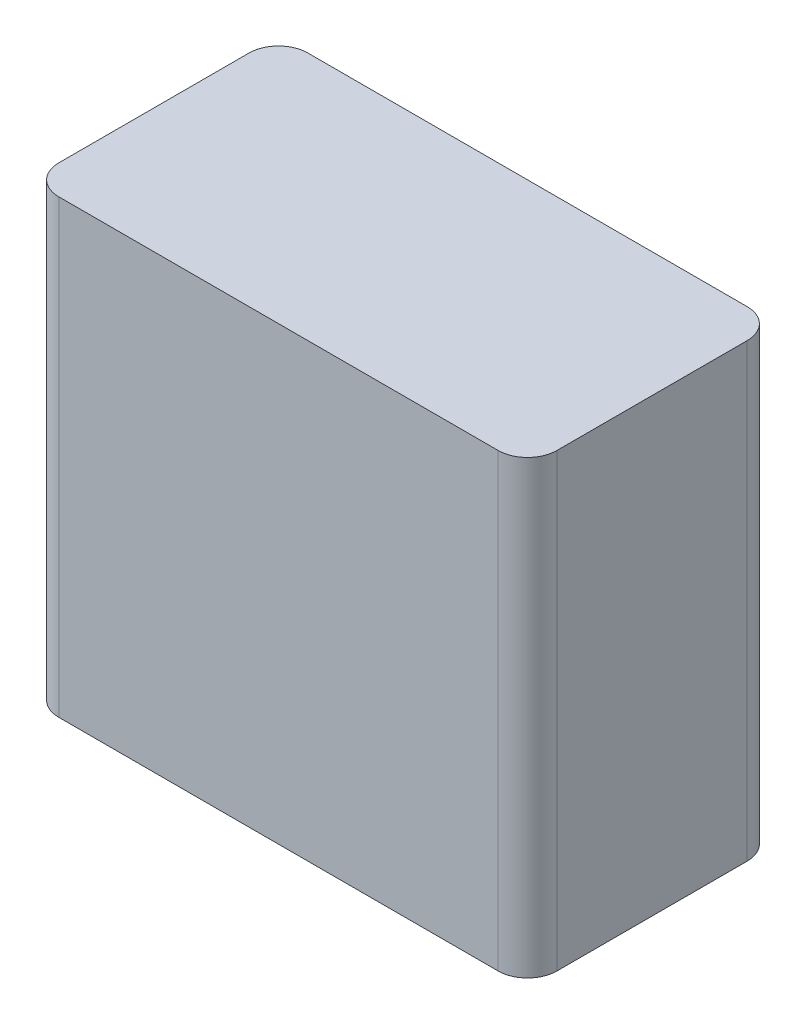
ISO-10303-21;
HEADER;
FILE_DESCRIPTION(('STEP AP214'),'2;1');
FILE_NAME('part.step','',(''),(''),'','','');
FILE_SCHEMA(('AUTOMOTIVE_DESIGN { 1 0 10303 214 1 1 1 1 }'));
ENDSEC;
DATA;
#1=APPLICATION_CONTEXT('core data for automotive mechanical design processes');
#2=APPLICATION_PROTOCOL_DEFINITION('international standard','automotive_design',2000,#1);
#3=PRODUCT_CONTEXT('',#1,'mechanical');
#4=PRODUCT('Part','Part','',(#3));
#5=PRODUCT_RELATED_PRODUCT_CATEGORY('part','',(#4));
#6=PRODUCT_DEFINITION_FORMATION('','',#4);
#7=PRODUCT_DEFINITION_CONTEXT('part definition',#1,'design');
#8=PRODUCT_DEFINITION('design','',#6,#7);
#9=PRODUCT_DEFINITION_SHAPE('','',#8);
#10=(LENGTH_UNIT() NAMED_UNIT(*) SI_UNIT(.MILLI.,.METRE.));
#11=(NAMED_UNIT(*) PLANE_ANGLE_UNIT() SI_UNIT($,.RADIAN.));
#12=(NAMED_UNIT(*) SI_UNIT($,.STERADIAN.) SOLID_ANGLE_UNIT());
#13=UNCERTAINTY_MEASURE_WITH_UNIT(LENGTH_MEASURE(1.E-05),#10,'distance_accuracy_value','');
#14=(GEOMETRIC_REPRESENTATION_CONTEXT(3) GLOBAL_UNCERTAINTY_ASSIGNED_CONTEXT((#13)) GLOBAL_UNIT_ASSIGNED_CONTEXT((#10,
#11,#12)) REPRESENTATION_CONTEXT('',''));
#15=CARTESIAN_POINT('',(0.,0.,0.));
#16=DIRECTION('',(0.,0.,1.));
#17=DIRECTION('',(1.,0.,0.));
#18=AXIS2_PLACEMENT_3D('',#15,#16,#17);
#19=CARTESIAN_POINT('',(-20.,36.2,10.));
#20=DIRECTION('',(1.,0.,0.));
#21=DIRECTION('',(0.,0.,-1.));
#22=AXIS2_PLACEMENT_3D('',#19,#20,#21);
#23=PLANE('',#22);
#24=DIRECTION('',(0.,0.,1.));
#25=VECTOR('',#24,1.);
#26=CARTESIAN_POINT('',(-20.,36.2,10.));
#27=LINE('',#26,#25);
#28=CARTESIAN_POINT('',(-20.,36.2,-7.63999999999999));
#29=VERTEX_POINT('',#28);
#30=CARTESIAN_POINT('',(-20.,36.2,7.64));
#31=VERTEX_POINT('',#30);
#32=EDGE_CURVE('E126',#29,#31,#27,.T.);
#33=ORIENTED_EDGE('',*,*,#32,.F.);
#34=DIRECTION('',(0.,-1.,0.));
#35=VECTOR('',#34,1.);
#36=CARTESIAN_POINT('',(-20.,36.2,-7.63999999999999));
#37=LINE('',#36,#35);
#38=CARTESIAN_POINT('',(-20.,0.,-7.63999999999999));
#39=VERTEX_POINT('',#38);
#40=EDGE_CURVE('E110',#29,#39,#37,.T.);
#41=ORIENTED_EDGE('',*,*,#40,.T.);
#42=DIRECTION('',(0.,0.,1.));
#43=VECTOR('',#42,1.);
#44=CARTESIAN_POINT('',(-20.,0.,10.));
#45=LINE('',#44,#43);
#46=CARTESIAN_POINT('',(-20.,0.,7.64));
#47=VERTEX_POINT('',#46);
#48=EDGE_CURVE('E123',#39,#47,#45,.T.);
#49=ORIENTED_EDGE('',*,*,#48,.T.);
#50=DIRECTION('',(0.,-1.,0.));
#51=VECTOR('',#50,1.);
#52=CARTESIAN_POINT('',(-20.,36.2,7.64));
#53=LINE('',#52,#51);
#54=EDGE_CURVE('E129',#47,#31,#53,.F.);
#55=ORIENTED_EDGE('',*,*,#54,.T.);
#56=EDGE_LOOP('',(#33,#41,#49,#55));
#57=FACE_BOUND('',#56,.T.);
#58=ADVANCED_FACE('F38',(#57),#23,.F.);
#59=CARTESIAN_POINT('',(20.,36.2,10.));
#60=DIRECTION('',(0.,0.,-1.));
#61=DIRECTION('',(-1.,0.,0.));
#62=AXIS2_PLACEMENT_3D('',#59,#60,#61);
#63=PLANE('',#62);
#64=DIRECTION('',(1.,0.,0.));
#65=VECTOR('',#64,1.);
#66=CARTESIAN_POINT('',(20.,36.2,10.));
#67=LINE('',#66,#65);
#68=CARTESIAN_POINT('',(-17.64,36.2,10.));
#69=VERTEX_POINT('',#68);
#70=CARTESIAN_POINT('',(17.64,36.2,10.));
#71=VERTEX_POINT('',#70);
#72=EDGE_CURVE('E184',#69,#71,#67,.T.);
#73=ORIENTED_EDGE('',*,*,#72,.F.);
#74=DIRECTION('',(0.,-1.,0.));
#75=VECTOR('',#74,1.);
#76=CARTESIAN_POINT('',(-17.64,36.2,10.));
#77=LINE('',#76,#75);
#78=CARTESIAN_POINT('',(-17.64,0.,10.));
#79=VERTEX_POINT('',#78);
#80=EDGE_CURVE('E11',#69,#79,#77,.T.);
#81=ORIENTED_EDGE('',*,*,#80,.T.);
#82=DIRECTION('',(1.,0.,0.));
#83=VECTOR('',#82,1.);
#84=CARTESIAN_POINT('',(20.,0.,10.));
#85=LINE('',#84,#83);
#86=CARTESIAN_POINT('',(17.64,0.,10.));
#87=VERTEX_POINT('',#86);
#88=EDGE_CURVE('E135',#79,#87,#85,.T.);
#89=ORIENTED_EDGE('',*,*,#88,.T.);
#90=DIRECTION('',(0.,-1.,0.));
#91=VECTOR('',#90,1.);
#92=CARTESIAN_POINT('',(17.64,36.2,10.));
#93=LINE('',#92,#91);
#94=EDGE_CURVE('E47',#87,#71,#93,.F.);
#95=ORIENTED_EDGE('',*,*,#94,.T.);
#96=EDGE_LOOP('',(#73,#81,#89,#95));
#97=FACE_BOUND('',#96,.T.);
#98=ADVANCED_FACE('F183',(#97),#63,.F.);
#99=CARTESIAN_POINT('',(20.,36.2,10.));
#100=DIRECTION('',(-1.,0.,0.));
#101=DIRECTION('',(0.,0.,1.));
#102=AXIS2_PLACEMENT_3D('',#99,#100,#101);
#103=PLANE('',#102);
#104=DIRECTION('',(0.,0.,-1.));
#105=VECTOR('',#104,1.);
#106=CARTESIAN_POINT('',(20.,0.,10.));
#107=LINE('',#106,#105);
#108=CARTESIAN_POINT('',(20.,0.,7.64));
#109=VERTEX_POINT('',#108);
#110=CARTESIAN_POINT('',(20.,0.,-7.64));
#111=VERTEX_POINT('',#110);
#112=EDGE_CURVE('E139',#109,#111,#107,.T.);
#113=ORIENTED_EDGE('',*,*,#112,.T.);
#114=DIRECTION('',(0.,-1.,0.));
#115=VECTOR('',#114,1.);
#116=CARTESIAN_POINT('',(20.,36.2,-7.64));
#117=LINE('',#116,#115);
#118=CARTESIAN_POINT('',(20.,36.2,-7.64));
#119=VERTEX_POINT('',#118);
#120=EDGE_CURVE('E54',#111,#119,#117,.F.);
#121=ORIENTED_EDGE('',*,*,#120,.T.);
#122=DIRECTION('',(0.,0.,-1.));
#123=VECTOR('',#122,1.);
#124=CARTESIAN_POINT('',(20.,36.2,10.));
#125=LINE('',#124,#123);
#126=CARTESIAN_POINT('',(20.,36.2,7.64));
#127=VERTEX_POINT('',#126);
#128=EDGE_CURVE('E191',#127,#119,#125,.T.);
#129=ORIENTED_EDGE('',*,*,#128,.F.);
#130=DIRECTION('',(0.,-1.,0.));
#131=VECTOR('',#130,1.);
#132=CARTESIAN_POINT('',(20.,36.2,7.64));
#133=LINE('',#132,#131);
#134=EDGE_CURVE('E174',#127,#109,#133,.T.);
#135=ORIENTED_EDGE('',*,*,#134,.T.);
#136=EDGE_LOOP('',(#113,#121,#129,#135));
#137=FACE_BOUND('',#136,.T.);
#138=ADVANCED_FACE('F195',(#137),#103,.F.);
#139=CARTESIAN_POINT('',(20.,36.2,-10.));
#140=DIRECTION('',(0.,0.,1.));
#141=DIRECTION('',(1.,0.,0.));
#142=AXIS2_PLACEMENT_3D('',#139,#140,#141);
#143=PLANE('',#142);
#144=DIRECTION('',(-1.,0.,0.));
#145=VECTOR('',#144,1.);
#146=CARTESIAN_POINT('',(20.,0.,-10.));
#147=LINE('',#146,#145);
#148=CARTESIAN_POINT('',(17.64,0.,-10.));
#149=VERTEX_POINT('',#148);
#150=CARTESIAN_POINT('',(-17.64,0.,-10.));
#151=VERTEX_POINT('',#150);
#152=EDGE_CURVE('E147',#149,#151,#147,.T.);
#153=ORIENTED_EDGE('',*,*,#152,.T.);
#154=DIRECTION('',(0.,-1.,0.));
#155=VECTOR('',#154,1.);
#156=CARTESIAN_POINT('',(-17.64,36.2,-10.));
#157=LINE('',#156,#155);
#158=CARTESIAN_POINT('',(-17.64,36.2,-10.));
#159=VERTEX_POINT('',#158);
#160=EDGE_CURVE('E111',#151,#159,#157,.F.);
#161=ORIENTED_EDGE('',*,*,#160,.T.);
#162=DIRECTION('',(-1.,0.,0.));
#163=VECTOR('',#162,1.);
#164=CARTESIAN_POINT('',(20.,36.2,-10.));
#165=LINE('',#164,#163);
#166=CARTESIAN_POINT('',(17.64,36.2,-10.));
#167=VERTEX_POINT('',#166);
#168=EDGE_CURVE('E142',#167,#159,#165,.T.);
#169=ORIENTED_EDGE('',*,*,#168,.F.);
#170=DIRECTION('',(0.,-1.,0.));
#171=VECTOR('',#170,1.);
#172=CARTESIAN_POINT('',(17.64,36.2,-10.));
#173=LINE('',#172,#171);
#174=EDGE_CURVE('E117',#167,#149,#173,.T.);
#175=ORIENTED_EDGE('',*,*,#174,.T.);
#176=EDGE_LOOP('',(#153,#161,#169,#175));
#177=FACE_BOUND('',#176,.T.);
#178=ADVANCED_FACE('F202',(#177),#143,.F.);
#179=CARTESIAN_POINT('',(0.,36.2,0.));
#180=DIRECTION('',(0.,1.,0.));
#181=DIRECTION('',(0.,0.,1.));
#182=AXIS2_PLACEMENT_3D('',#179,#180,#181);
#183=PLANE('',#182);
#184=ORIENTED_EDGE('',*,*,#168,.T.);
#185=CARTESIAN_POINT('',(-17.64,36.2,-7.63999999999999));
#186=DIRECTION('',(0.,1.,0.));
#187=DIRECTION('',(0.,0.,1.));
#188=AXIS2_PLACEMENT_3D('',#185,#186,#187);
#189=CIRCLE('',#188,2.36);
#190=EDGE_CURVE('E171',#159,#29,#189,.T.);
#191=ORIENTED_EDGE('',*,*,#190,.T.);
#192=ORIENTED_EDGE('',*,*,#32,.T.);
#193=CARTESIAN_POINT('',(-17.64,36.2,7.64));
#194=DIRECTION('',(0.,1.,0.));
#195=DIRECTION('',(0.,0.,1.));
#196=AXIS2_PLACEMENT_3D('',#193,#194,#195);
#197=CIRCLE('',#196,2.36);
#198=EDGE_CURVE('E165',#31,#69,#197,.T.);
#199=ORIENTED_EDGE('',*,*,#198,.T.);
#200=ORIENTED_EDGE('',*,*,#72,.T.);
#201=CARTESIAN_POINT('',(17.64,36.2,7.64));
#202=DIRECTION('',(0.,1.,0.));
#203=DIRECTION('',(0.,0.,1.));
#204=AXIS2_PLACEMENT_3D('',#201,#202,#203);
#205=CIRCLE('',#204,2.36);
#206=EDGE_CURVE('E61',#71,#127,#205,.T.);
#207=ORIENTED_EDGE('',*,*,#206,.T.);
#208=ORIENTED_EDGE('',*,*,#128,.T.);
#209=CARTESIAN_POINT('',(17.64,36.2,-7.64));
#210=DIRECTION('',(0.,1.,0.));
#211=DIRECTION('',(0.,0.,1.));
#212=AXIS2_PLACEMENT_3D('',#209,#210,#211);
#213=CIRCLE('',#212,2.36);
#214=EDGE_CURVE('E168',#119,#167,#213,.T.);
#215=ORIENTED_EDGE('',*,*,#214,.T.);
#216=EDGE_LOOP('',(#184,#191,#192,#199,#200,#207,#208,#215));
#217=FACE_BOUND('',#216,.T.);
#218=ADVANCED_FACE('F188',(#217),#183,.T.);
#219=CARTESIAN_POINT('',(0.,0.,0.));
#220=DIRECTION('',(0.,1.,0.));
#221=DIRECTION('',(0.,0.,1.));
#222=AXIS2_PLACEMENT_3D('',#219,#220,#221);
#223=PLANE('',#222);
#224=ORIENTED_EDGE('',*,*,#48,.F.);
#225=CARTESIAN_POINT('',(-17.64,0.,-7.63999999999999));
#226=DIRECTION('',(0.,1.,0.));
#227=DIRECTION('',(0.,0.,1.));
#228=AXIS2_PLACEMENT_3D('',#225,#226,#227);
#229=CIRCLE('',#228,2.36);
#230=EDGE_CURVE('E106',#39,#151,#229,.F.);
#231=ORIENTED_EDGE('',*,*,#230,.T.);
#232=ORIENTED_EDGE('',*,*,#152,.F.);
#233=CARTESIAN_POINT('',(17.64,0.,-7.64));
#234=DIRECTION('',(0.,1.,0.));
#235=DIRECTION('',(0.,0.,1.));
#236=AXIS2_PLACEMENT_3D('',#233,#234,#235);
#237=CIRCLE('',#236,2.36);
#238=EDGE_CURVE('E118',#149,#111,#237,.F.);
#239=ORIENTED_EDGE('',*,*,#238,.T.);
#240=ORIENTED_EDGE('',*,*,#112,.F.);
#241=CARTESIAN_POINT('',(17.64,0.,7.64));
#242=DIRECTION('',(0.,1.,0.));
#243=DIRECTION('',(0.,0.,1.));
#244=AXIS2_PLACEMENT_3D('',#241,#242,#243);
#245=CIRCLE('',#244,2.36);
#246=EDGE_CURVE('E128',#109,#87,#245,.F.);
#247=ORIENTED_EDGE('',*,*,#246,.T.);
#248=ORIENTED_EDGE('',*,*,#88,.F.);
#249=CARTESIAN_POINT('',(-17.64,0.,7.64));
#250=DIRECTION('',(0.,1.,0.));
#251=DIRECTION('',(0.,0.,1.));
#252=AXIS2_PLACEMENT_3D('',#249,#250,#251);
#253=CIRCLE('',#252,2.36);
#254=EDGE_CURVE('E133',#79,#47,#253,.F.);
#255=ORIENTED_EDGE('',*,*,#254,.T.);
#256=EDGE_LOOP('',(#224,#231,#232,#239,#240,#247,#248,#255));
#257=FACE_BOUND('',#256,.T.);
#258=ADVANCED_FACE('F131',(#257),#223,.F.);
#259=CARTESIAN_POINT('',(-17.64,36.2,-7.63999999999999));
#260=DIRECTION('',(0.,-1.,0.));
#261=DIRECTION('',(0.,0.,-1.));
#262=AXIS2_PLACEMENT_3D('',#259,#260,#261);
#263=CYLINDRICAL_SURFACE('',#262,2.36);
#264=ORIENTED_EDGE('',*,*,#190,.F.);
#265=ORIENTED_EDGE('',*,*,#160,.F.);
#266=ORIENTED_EDGE('',*,*,#230,.F.);
#267=ORIENTED_EDGE('',*,*,#40,.F.);
#268=EDGE_LOOP('',(#264,#265,#266,#267));
#269=FACE_BOUND('',#268,.T.);
#270=ADVANCED_FACE('F109',(#269),#263,.T.);
#271=CARTESIAN_POINT('',(17.64,36.2,-7.64));
#272=DIRECTION('',(0.,-1.,0.));
#273=DIRECTION('',(0.,0.,-1.));
#274=AXIS2_PLACEMENT_3D('',#271,#272,#273);
#275=CYLINDRICAL_SURFACE('',#274,2.36);
#276=ORIENTED_EDGE('',*,*,#214,.F.);
#277=ORIENTED_EDGE('',*,*,#120,.F.);
#278=ORIENTED_EDGE('',*,*,#238,.F.);
#279=ORIENTED_EDGE('',*,*,#174,.F.);
#280=EDGE_LOOP('',(#276,#277,#278,#279));
#281=FACE_BOUND('',#280,.T.);
#282=ADVANCED_FACE('F199',(#281),#275,.T.);
#283=CARTESIAN_POINT('',(-17.64,36.2,7.64));
#284=DIRECTION('',(0.,-1.,0.));
#285=DIRECTION('',(0.,0.,-1.));
#286=AXIS2_PLACEMENT_3D('',#283,#284,#285);
#287=CYLINDRICAL_SURFACE('',#286,2.36);
#288=ORIENTED_EDGE('',*,*,#198,.F.);
#289=ORIENTED_EDGE('',*,*,#54,.F.);
#290=ORIENTED_EDGE('',*,*,#254,.F.);
#291=ORIENTED_EDGE('',*,*,#80,.F.);
#292=EDGE_LOOP('',(#288,#289,#290,#291));
#293=FACE_BOUND('',#292,.T.);
#294=ADVANCED_FACE('F208',(#293),#287,.T.);
#295=CARTESIAN_POINT('',(17.64,36.2,7.64));
#296=DIRECTION('',(0.,-1.,0.));
#297=DIRECTION('',(0.,0.,-1.));
#298=AXIS2_PLACEMENT_3D('',#295,#296,#297);
#299=CYLINDRICAL_SURFACE('',#298,2.36);
#300=ORIENTED_EDGE('',*,*,#206,.F.);
#301=ORIENTED_EDGE('',*,*,#94,.F.);
#302=ORIENTED_EDGE('',*,*,#246,.F.);
#303=ORIENTED_EDGE('',*,*,#134,.F.);
#304=EDGE_LOOP('',(#300,#301,#302,#303));
#305=FACE_BOUND('',#304,.T.);
#306=ADVANCED_FACE('F40',(#305),#299,.T.);
#307=CLOSED_SHELL('',(#58,#98,#138,#178,#218,#258,#270,#282,#294,#306));
#308=MANIFOLD_SOLID_BREP('B2',#307);
#309=ADVANCED_BREP_SHAPE_REPRESENTATION('',(#18,#308),#14);
#310=SHAPE_DEFINITION_REPRESENTATION(#9,#309);
ENDSEC;
END-ISO-10303-21;
